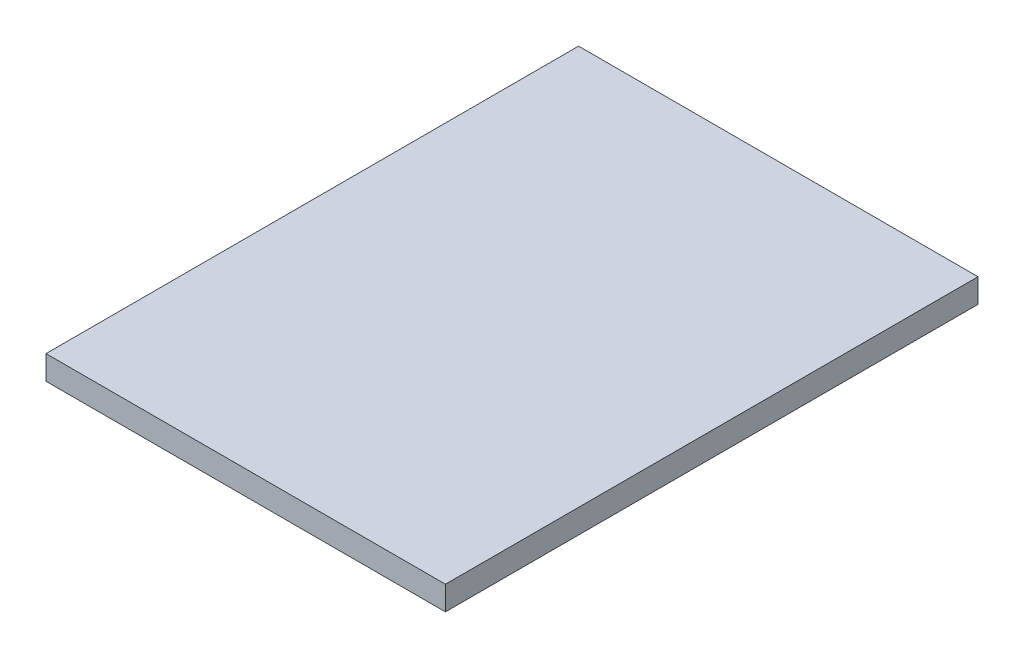
ISO-10303-21;
HEADER;
FILE_DESCRIPTION(('STEP AP214'),'2;1');
FILE_NAME('part.step','',(''),(''),'','','');
FILE_SCHEMA(('AUTOMOTIVE_DESIGN { 1 0 10303 214 1 1 1 1 }'));
ENDSEC;
DATA;
#1=APPLICATION_CONTEXT('core data for automotive mechanical design processes');
#2=APPLICATION_PROTOCOL_DEFINITION('international standard','automotive_design',2000,#1);
#3=PRODUCT_CONTEXT('',#1,'mechanical');
#4=PRODUCT('Part','Part','',(#3));
#5=PRODUCT_RELATED_PRODUCT_CATEGORY('part','',(#4));
#6=PRODUCT_DEFINITION_FORMATION('','',#4);
#7=PRODUCT_DEFINITION_CONTEXT('part definition',#1,'design');
#8=PRODUCT_DEFINITION('design','',#6,#7);
#9=PRODUCT_DEFINITION_SHAPE('','',#8);
#10=(LENGTH_UNIT() NAMED_UNIT(*) SI_UNIT(.MILLI.,.METRE.));
#11=(NAMED_UNIT(*) PLANE_ANGLE_UNIT() SI_UNIT($,.RADIAN.));
#12=(NAMED_UNIT(*) SI_UNIT($,.STERADIAN.) SOLID_ANGLE_UNIT());
#13=UNCERTAINTY_MEASURE_WITH_UNIT(LENGTH_MEASURE(1.E-05),#10,'distance_accuracy_value','');
#14=(GEOMETRIC_REPRESENTATION_CONTEXT(3) GLOBAL_UNCERTAINTY_ASSIGNED_CONTEXT((#13)) GLOBAL_UNIT_ASSIGNED_CONTEXT((#10,
#11,#12)) REPRESENTATION_CONTEXT('',''));
#15=CARTESIAN_POINT('',(0.,0.,0.));
#16=DIRECTION('',(0.,0.,1.));
#17=DIRECTION('',(1.,0.,0.));
#18=AXIS2_PLACEMENT_3D('',#15,#16,#17);
#19=CARTESIAN_POINT('',(0.,18.,0.));
#20=DIRECTION('',(1.,0.,0.));
#21=DIRECTION('',(0.,0.,-1.));
#22=AXIS2_PLACEMENT_3D('',#19,#20,#21);
#23=PLANE('',#22);
#24=DIRECTION('',(0.,0.,1.));
#25=VECTOR('',#24,1.);
#26=CARTESIAN_POINT('',(0.,0.,0.));
#27=LINE('',#26,#25);
#28=CARTESIAN_POINT('',(0.,0.,-400.));
#29=VERTEX_POINT('',#28);
#30=CARTESIAN_POINT('',(0.,0.,0.));
#31=VERTEX_POINT('',#30);
#32=EDGE_CURVE('E96',#29,#31,#27,.T.);
#33=ORIENTED_EDGE('',*,*,#32,.T.);
#34=DIRECTION('',(0.,-1.,0.));
#35=VECTOR('',#34,1.);
#36=CARTESIAN_POINT('',(0.,18.,0.));
#37=LINE('',#36,#35);
#38=CARTESIAN_POINT('',(0.,18.,0.));
#39=VERTEX_POINT('',#38);
#40=EDGE_CURVE('E11',#39,#31,#37,.T.);
#41=ORIENTED_EDGE('',*,*,#40,.F.);
#42=DIRECTION('',(0.,0.,1.));
#43=VECTOR('',#42,1.);
#44=CARTESIAN_POINT('',(0.,18.,0.));
#45=LINE('',#44,#43);
#46=CARTESIAN_POINT('',(0.,18.,-400.));
#47=VERTEX_POINT('',#46);
#48=EDGE_CURVE('E84',#47,#39,#45,.T.);
#49=ORIENTED_EDGE('',*,*,#48,.F.);
#50=DIRECTION('',(0.,-1.,0.));
#51=VECTOR('',#50,1.);
#52=CARTESIAN_POINT('',(0.,18.,-400.));
#53=LINE('',#52,#51);
#54=EDGE_CURVE('E92',#47,#29,#53,.T.);
#55=ORIENTED_EDGE('',*,*,#54,.T.);
#56=EDGE_LOOP('',(#33,#41,#49,#55));
#57=FACE_BOUND('',#56,.T.);
#58=ADVANCED_FACE('F33',(#57),#23,.F.);
#59=CARTESIAN_POINT('',(0.,18.,0.));
#60=DIRECTION('',(0.,0.,-1.));
#61=DIRECTION('',(-1.,0.,0.));
#62=AXIS2_PLACEMENT_3D('',#59,#60,#61);
#63=PLANE('',#62);
#64=DIRECTION('',(1.,0.,0.));
#65=VECTOR('',#64,1.);
#66=CARTESIAN_POINT('',(0.,0.,0.));
#67=LINE('',#66,#65);
#68=CARTESIAN_POINT('',(300.,0.,0.));
#69=VERTEX_POINT('',#68);
#70=EDGE_CURVE('E88',#31,#69,#67,.T.);
#71=ORIENTED_EDGE('',*,*,#70,.T.);
#72=DIRECTION('',(0.,-1.,0.));
#73=VECTOR('',#72,1.);
#74=CARTESIAN_POINT('',(300.,18.,0.));
#75=LINE('',#74,#73);
#76=CARTESIAN_POINT('',(300.,18.,0.));
#77=VERTEX_POINT('',#76);
#78=EDGE_CURVE('E41',#77,#69,#75,.T.);
#79=ORIENTED_EDGE('',*,*,#78,.F.);
#80=DIRECTION('',(1.,0.,0.));
#81=VECTOR('',#80,1.);
#82=CARTESIAN_POINT('',(0.,18.,0.));
#83=LINE('',#82,#81);
#84=EDGE_CURVE('E79',#39,#77,#83,.T.);
#85=ORIENTED_EDGE('',*,*,#84,.F.);
#86=ORIENTED_EDGE('',*,*,#40,.T.);
#87=EDGE_LOOP('',(#71,#79,#85,#86));
#88=FACE_BOUND('',#87,.T.);
#89=ADVANCED_FACE('F87',(#88),#63,.F.);
#90=CARTESIAN_POINT('',(300.,18.,0.));
#91=DIRECTION('',(-1.,0.,0.));
#92=DIRECTION('',(0.,0.,1.));
#93=AXIS2_PLACEMENT_3D('',#90,#91,#92);
#94=PLANE('',#93);
#95=DIRECTION('',(0.,0.,-1.));
#96=VECTOR('',#95,1.);
#97=CARTESIAN_POINT('',(300.,0.,0.));
#98=LINE('',#97,#96);
#99=CARTESIAN_POINT('',(300.,0.,-400.));
#100=VERTEX_POINT('',#99);
#101=EDGE_CURVE('E66',#69,#100,#98,.T.);
#102=ORIENTED_EDGE('',*,*,#101,.T.);
#103=DIRECTION('',(0.,-1.,0.));
#104=VECTOR('',#103,1.);
#105=CARTESIAN_POINT('',(300.,18.,-400.));
#106=LINE('',#105,#104);
#107=CARTESIAN_POINT('',(300.,18.,-400.));
#108=VERTEX_POINT('',#107);
#109=EDGE_CURVE('E89',#108,#100,#106,.T.);
#110=ORIENTED_EDGE('',*,*,#109,.F.);
#111=DIRECTION('',(0.,0.,-1.));
#112=VECTOR('',#111,1.);
#113=CARTESIAN_POINT('',(300.,18.,0.));
#114=LINE('',#113,#112);
#115=EDGE_CURVE('E82',#77,#108,#114,.T.);
#116=ORIENTED_EDGE('',*,*,#115,.F.);
#117=ORIENTED_EDGE('',*,*,#78,.T.);
#118=EDGE_LOOP('',(#102,#110,#116,#117));
#119=FACE_BOUND('',#118,.T.);
#120=ADVANCED_FACE('F90',(#119),#94,.F.);
#121=CARTESIAN_POINT('',(0.,18.,-400.));
#122=DIRECTION('',(0.,0.,1.));
#123=DIRECTION('',(1.,0.,0.));
#124=AXIS2_PLACEMENT_3D('',#121,#122,#123);
#125=PLANE('',#124);
#126=DIRECTION('',(-1.,0.,0.));
#127=VECTOR('',#126,1.);
#128=CARTESIAN_POINT('',(0.,0.,-400.));
#129=LINE('',#128,#127);
#130=EDGE_CURVE('E72',#100,#29,#129,.T.);
#131=ORIENTED_EDGE('',*,*,#130,.T.);
#132=ORIENTED_EDGE('',*,*,#54,.F.);
#133=DIRECTION('',(-1.,0.,0.));
#134=VECTOR('',#133,1.);
#135=CARTESIAN_POINT('',(0.,18.,-400.));
#136=LINE('',#135,#134);
#137=EDGE_CURVE('E49',#108,#47,#136,.T.);
#138=ORIENTED_EDGE('',*,*,#137,.F.);
#139=ORIENTED_EDGE('',*,*,#109,.T.);
#140=EDGE_LOOP('',(#131,#132,#138,#139));
#141=FACE_BOUND('',#140,.T.);
#142=ADVANCED_FACE('F103',(#141),#125,.F.);
#143=CARTESIAN_POINT('',(0.,18.,0.));
#144=DIRECTION('',(0.,-1.,0.));
#145=DIRECTION('',(0.,0.,-1.));
#146=AXIS2_PLACEMENT_3D('',#143,#144,#145);
#147=PLANE('',#146);
#148=ORIENTED_EDGE('',*,*,#48,.T.);
#149=ORIENTED_EDGE('',*,*,#84,.T.);
#150=ORIENTED_EDGE('',*,*,#115,.T.);
#151=ORIENTED_EDGE('',*,*,#137,.T.);
#152=EDGE_LOOP('',(#148,#149,#150,#151));
#153=FACE_BOUND('',#152,.T.);
#154=ADVANCED_FACE('F80',(#153),#147,.F.);
#155=CARTESIAN_POINT('',(0.,0.,0.));
#156=DIRECTION('',(0.,-1.,0.));
#157=DIRECTION('',(0.,0.,-1.));
#158=AXIS2_PLACEMENT_3D('',#155,#156,#157);
#159=PLANE('',#158);
#160=ORIENTED_EDGE('',*,*,#32,.F.);
#161=ORIENTED_EDGE('',*,*,#130,.F.);
#162=ORIENTED_EDGE('',*,*,#101,.F.);
#163=ORIENTED_EDGE('',*,*,#70,.F.);
#164=EDGE_LOOP('',(#160,#161,#162,#163));
#165=FACE_BOUND('',#164,.T.);
#166=ADVANCED_FACE('F106',(#165),#159,.T.);
#167=CLOSED_SHELL('',(#58,#89,#120,#142,#154,#166));
#168=MANIFOLD_SOLID_BREP('B2',#167);
#169=ADVANCED_BREP_SHAPE_REPRESENTATION('',(#18,#168),#14);
#170=SHAPE_DEFINITION_REPRESENTATION(#9,#169);
ENDSEC;
END-ISO-10303-21;
